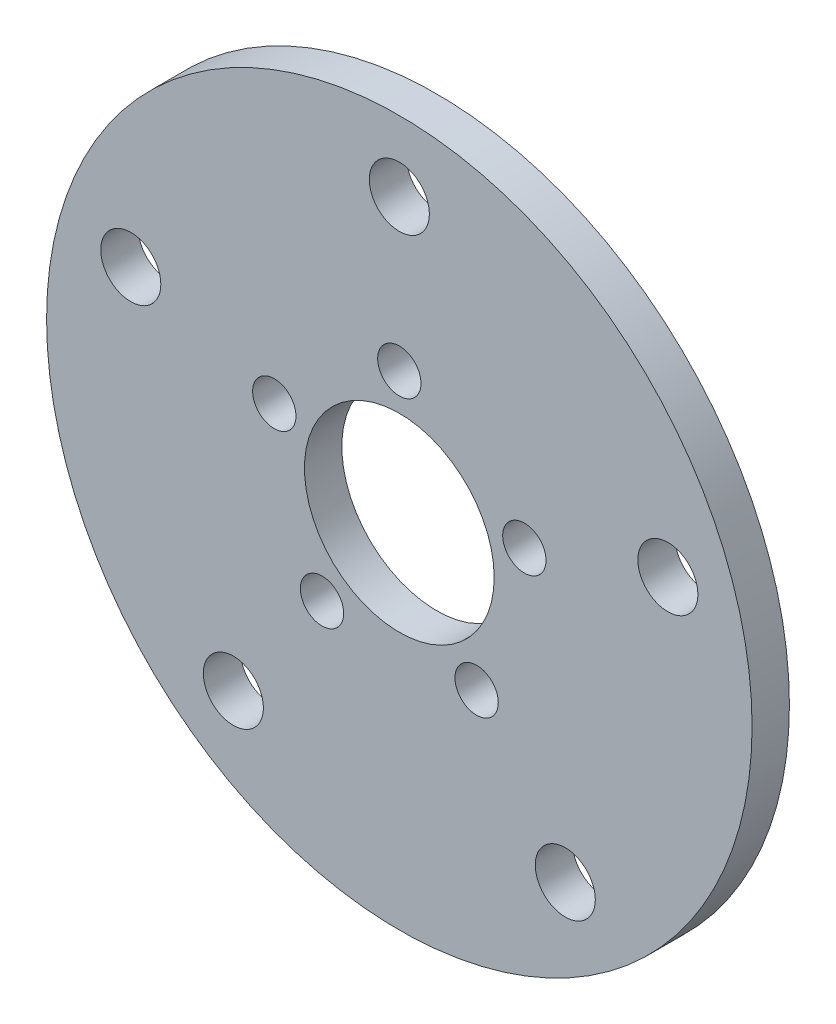
ISO-10303-21;
HEADER;
FILE_DESCRIPTION(('STEP AP214'),'2;1');
FILE_NAME('part.step','',(''),(''),'','','');
FILE_SCHEMA(('AUTOMOTIVE_DESIGN { 1 0 10303 214 1 1 1 1 }'));
ENDSEC;
DATA;
#1=APPLICATION_CONTEXT('core data for automotive mechanical design processes');
#2=APPLICATION_PROTOCOL_DEFINITION('international standard','automotive_design',2000,#1);
#3=PRODUCT_CONTEXT('',#1,'mechanical');
#4=PRODUCT('Part','Part','',(#3));
#5=PRODUCT_RELATED_PRODUCT_CATEGORY('part','',(#4));
#6=PRODUCT_DEFINITION_FORMATION('','',#4);
#7=PRODUCT_DEFINITION_CONTEXT('part definition',#1,'design');
#8=PRODUCT_DEFINITION('design','',#6,#7);
#9=PRODUCT_DEFINITION_SHAPE('','',#8);
#10=(LENGTH_UNIT() NAMED_UNIT(*) SI_UNIT(.MILLI.,.METRE.));
#11=(NAMED_UNIT(*) PLANE_ANGLE_UNIT() SI_UNIT($,.RADIAN.));
#12=(NAMED_UNIT(*) SI_UNIT($,.STERADIAN.) SOLID_ANGLE_UNIT());
#13=UNCERTAINTY_MEASURE_WITH_UNIT(LENGTH_MEASURE(1.E-05),#10,'distance_accuracy_value','');
#14=(GEOMETRIC_REPRESENTATION_CONTEXT(3) GLOBAL_UNCERTAINTY_ASSIGNED_CONTEXT((#13)) GLOBAL_UNIT_ASSIGNED_CONTEXT((#10,
#11,#12)) REPRESENTATION_CONTEXT('',''));
#15=CARTESIAN_POINT('',(0.,0.,0.));
#16=DIRECTION('',(0.,0.,1.));
#17=DIRECTION('',(1.,0.,0.));
#18=AXIS2_PLACEMENT_3D('',#15,#16,#17);
#19=CARTESIAN_POINT('',(0.,0.,3.175));
#20=DIRECTION('',(0.,0.,1.));
#21=DIRECTION('',(1.,0.,0.));
#22=AXIS2_PLACEMENT_3D('',#19,#20,#21);
#23=PLANE('',#22);
#24=CARTESIAN_POINT('',(-10.6290076261146,3.45357392913453,3.175));
#25=DIRECTION('',(0.,0.,1.));
#26=DIRECTION('',(1.,0.,0.));
#27=AXIS2_PLACEMENT_3D('',#24,#25,#26);
#28=CIRCLE('',#27,1.8415);
#29=CARTESIAN_POINT('',(-8.7875076261146,3.45357392913453,3.175));
#30=VERTEX_POINT('',#29);
#31=EDGE_CURVE('E101',#30,#30,#28,.T.);
#32=ORIENTED_EDGE('',*,*,#31,.F.);
#33=EDGE_LOOP('',(#32));
#34=FACE_BOUND('',#33,.T.);
#35=CARTESIAN_POINT('',(-6.56908797962076,-9.04157392913436,3.175));
#36=DIRECTION('',(0.,0.,1.));
#37=DIRECTION('',(1.,0.,0.));
#38=AXIS2_PLACEMENT_3D('',#35,#36,#37);
#39=CIRCLE('',#38,1.8415);
#40=CARTESIAN_POINT('',(-4.72758797962076,-9.04157392913436,3.175));
#41=VERTEX_POINT('',#40);
#42=EDGE_CURVE('E89',#41,#41,#39,.T.);
#43=ORIENTED_EDGE('',*,*,#42,.F.);
#44=EDGE_LOOP('',(#43));
#45=FACE_BOUND('',#44,.T.);
#46=CARTESIAN_POINT('',(6.56908797962063,-9.04157392913445,3.175));
#47=DIRECTION('',(0.,0.,1.));
#48=DIRECTION('',(1.,0.,0.));
#49=AXIS2_PLACEMENT_3D('',#46,#47,#48);
#50=CIRCLE('',#49,1.8415);
#51=CARTESIAN_POINT('',(8.41058797962063,-9.04157392913445,3.175));
#52=VERTEX_POINT('',#51);
#53=EDGE_CURVE('E77',#52,#52,#50,.T.);
#54=ORIENTED_EDGE('',*,*,#53,.F.);
#55=EDGE_LOOP('',(#54));
#56=FACE_BOUND('',#55,.T.);
#57=CARTESIAN_POINT('',(10.6290076261147,3.45357392913438,3.175));
#58=DIRECTION('',(0.,0.,1.));
#59=DIRECTION('',(1.,0.,0.));
#60=AXIS2_PLACEMENT_3D('',#57,#58,#59);
#61=CIRCLE('',#60,1.8415);
#62=CARTESIAN_POINT('',(12.4705076261146,3.45357392913438,3.175));
#63=VERTEX_POINT('',#62);
#64=EDGE_CURVE('E65',#63,#63,#61,.T.);
#65=ORIENTED_EDGE('',*,*,#64,.F.);
#66=EDGE_LOOP('',(#65));
#67=FACE_BOUND('',#66,.T.);
#68=CARTESIAN_POINT('',(0.,11.176,3.175));
#69=DIRECTION('',(0.,0.,1.));
#70=DIRECTION('',(1.,0.,0.));
#71=AXIS2_PLACEMENT_3D('',#68,#69,#70);
#72=CIRCLE('',#71,1.8415);
#73=CARTESIAN_POINT('',(1.8415,11.176,3.175));
#74=VERTEX_POINT('',#73);
#75=EDGE_CURVE('E53',#74,#74,#72,.T.);
#76=ORIENTED_EDGE('',*,*,#75,.F.);
#77=EDGE_LOOP('',(#76));
#78=FACE_BOUND('',#77,.T.);
#79=CARTESIAN_POINT('',(0.,0.,3.175));
#80=DIRECTION('',(0.,0.,1.));
#81=DIRECTION('',(1.,0.,0.));
#82=AXIS2_PLACEMENT_3D('',#79,#80,#81);
#83=CIRCLE('',#82,29.9846999999994);
#84=CARTESIAN_POINT('',(29.9846999999994,0.,3.175));
#85=VERTEX_POINT('',#84);
#86=EDGE_CURVE('E10',#85,#85,#83,.T.);
#87=ORIENTED_EDGE('',*,*,#86,.T.);
#88=EDGE_LOOP('',(#87));
#89=FACE_BOUND('',#88,.T.);
#90=CARTESIAN_POINT('',(0.,0.,3.175));
#91=DIRECTION('',(0.,0.,1.));
#92=DIRECTION('',(1.,0.,0.));
#93=AXIS2_PLACEMENT_3D('',#90,#91,#92);
#94=CIRCLE('',#93,8.0645);
#95=CARTESIAN_POINT('',(8.0645,0.,3.175));
#96=VERTEX_POINT('',#95);
#97=EDGE_CURVE('E48',#96,#96,#94,.T.);
#98=ORIENTED_EDGE('',*,*,#97,.F.);
#99=EDGE_LOOP('',(#98));
#100=FACE_BOUND('',#99,.T.);
#101=CARTESIAN_POINT('',(0.,24.000000006,3.175));
#102=DIRECTION('',(0.,0.,1.));
#103=DIRECTION('',(1.,0.,0.));
#104=AXIS2_PLACEMENT_3D('',#101,#102,#103);
#105=CIRCLE('',#104,2.55270000000001);
#106=CARTESIAN_POINT('',(2.55270000000008,24.000000006,3.175));
#107=VERTEX_POINT('',#106);
#108=EDGE_CURVE('E59',#107,#107,#105,.T.);
#109=ORIENTED_EDGE('',*,*,#108,.F.);
#110=EDGE_LOOP('',(#109));
#111=FACE_BOUND('',#110,.T.);
#112=CARTESIAN_POINT('',(22.8253563967901,7.41640786685277,3.175));
#113=DIRECTION('',(0.,0.,1.));
#114=DIRECTION('',(1.,0.,0.));
#115=AXIS2_PLACEMENT_3D('',#112,#113,#114);
#116=CIRCLE('',#115,2.55269999999992);
#117=CARTESIAN_POINT('',(25.37805639679,7.41640786685277,3.175));
#118=VERTEX_POINT('',#117);
#119=EDGE_CURVE('E71',#118,#118,#116,.T.);
#120=ORIENTED_EDGE('',*,*,#119,.F.);
#121=EDGE_LOOP('',(#120));
#122=FACE_BOUND('',#121,.T.);
#123=CARTESIAN_POINT('',(14.1068460585461,-19.4164078698529,3.175));
#124=DIRECTION('',(0.,0.,1.));
#125=DIRECTION('',(1.,0.,0.));
#126=AXIS2_PLACEMENT_3D('',#123,#124,#125);
#127=CIRCLE('',#126,2.55270000000003);
#128=CARTESIAN_POINT('',(16.6595460585461,-19.4164078698529,3.175));
#129=VERTEX_POINT('',#128);
#130=EDGE_CURVE('E83',#129,#129,#127,.T.);
#131=ORIENTED_EDGE('',*,*,#130,.F.);
#132=EDGE_LOOP('',(#131));
#133=FACE_BOUND('',#132,.T.);
#134=CARTESIAN_POINT('',(-14.1068460585461,-19.4164078698528,3.175));
#135=DIRECTION('',(0.,0.,1.));
#136=DIRECTION('',(1.,0.,0.));
#137=AXIS2_PLACEMENT_3D('',#134,#135,#136);
#138=CIRCLE('',#137,2.55270000000003);
#139=CARTESIAN_POINT('',(-11.5541460585461,-19.4164078698528,3.175));
#140=VERTEX_POINT('',#139);
#141=EDGE_CURVE('E95',#140,#140,#138,.T.);
#142=ORIENTED_EDGE('',*,*,#141,.F.);
#143=EDGE_LOOP('',(#142));
#144=FACE_BOUND('',#143,.T.);
#145=CARTESIAN_POINT('',(-22.82535639679,7.41640786685288,3.175));
#146=DIRECTION('',(0.,0.,1.));
#147=DIRECTION('',(1.,0.,0.));
#148=AXIS2_PLACEMENT_3D('',#145,#146,#147);
#149=CIRCLE('',#148,2.55269999999992);
#150=CARTESIAN_POINT('',(-20.27265639679,7.41640786685288,3.175));
#151=VERTEX_POINT('',#150);
#152=EDGE_CURVE('E107',#151,#151,#149,.T.);
#153=ORIENTED_EDGE('',*,*,#152,.F.);
#154=EDGE_LOOP('',(#153));
#155=FACE_BOUND('',#154,.T.);
#156=ADVANCED_FACE('F37',(#34,#45,#56,#67,#78,#89,#100,#111,#122,#133,#144,#155),#23,.T.);
#157=CARTESIAN_POINT('',(0.,0.,0.));
#158=DIRECTION('',(0.,0.,1.));
#159=DIRECTION('',(1.,0.,0.));
#160=AXIS2_PLACEMENT_3D('',#157,#158,#159);
#161=PLANE('',#160);
#162=CARTESIAN_POINT('',(0.,0.,0.));
#163=DIRECTION('',(0.,0.,1.));
#164=DIRECTION('',(1.,0.,0.));
#165=AXIS2_PLACEMENT_3D('',#162,#163,#164);
#166=CIRCLE('',#165,29.9846999999994);
#167=CARTESIAN_POINT('',(29.9846999999994,0.,0.));
#168=VERTEX_POINT('',#167);
#169=EDGE_CURVE('E41',#168,#168,#166,.T.);
#170=ORIENTED_EDGE('',*,*,#169,.F.);
#171=EDGE_LOOP('',(#170));
#172=FACE_BOUND('',#171,.T.);
#173=CARTESIAN_POINT('',(0.,0.,0.));
#174=DIRECTION('',(0.,0.,1.));
#175=DIRECTION('',(1.,0.,0.));
#176=AXIS2_PLACEMENT_3D('',#173,#174,#175);
#177=CIRCLE('',#176,8.0645);
#178=CARTESIAN_POINT('',(8.0645,0.,0.));
#179=VERTEX_POINT('',#178);
#180=EDGE_CURVE('E50',#179,#179,#177,.T.);
#181=ORIENTED_EDGE('',*,*,#180,.T.);
#182=EDGE_LOOP('',(#181));
#183=FACE_BOUND('',#182,.T.);
#184=CARTESIAN_POINT('',(0.,11.176,0.));
#185=DIRECTION('',(0.,0.,1.));
#186=DIRECTION('',(1.,0.,0.));
#187=AXIS2_PLACEMENT_3D('',#184,#185,#186);
#188=CIRCLE('',#187,1.8415);
#189=CARTESIAN_POINT('',(1.8415,11.176,0.));
#190=VERTEX_POINT('',#189);
#191=EDGE_CURVE('E56',#190,#190,#188,.T.);
#192=ORIENTED_EDGE('',*,*,#191,.T.);
#193=EDGE_LOOP('',(#192));
#194=FACE_BOUND('',#193,.T.);
#195=CARTESIAN_POINT('',(0.,24.000000006,0.));
#196=DIRECTION('',(0.,0.,1.));
#197=DIRECTION('',(1.,0.,0.));
#198=AXIS2_PLACEMENT_3D('',#195,#196,#197);
#199=CIRCLE('',#198,2.55270000000001);
#200=CARTESIAN_POINT('',(2.55270000000008,24.000000006,0.));
#201=VERTEX_POINT('',#200);
#202=EDGE_CURVE('E62',#201,#201,#199,.T.);
#203=ORIENTED_EDGE('',*,*,#202,.T.);
#204=EDGE_LOOP('',(#203));
#205=FACE_BOUND('',#204,.T.);
#206=CARTESIAN_POINT('',(10.6290076261147,3.45357392913438,0.));
#207=DIRECTION('',(0.,0.,1.));
#208=DIRECTION('',(1.,0.,0.));
#209=AXIS2_PLACEMENT_3D('',#206,#207,#208);
#210=CIRCLE('',#209,1.8415);
#211=CARTESIAN_POINT('',(12.4705076261146,3.45357392913438,0.));
#212=VERTEX_POINT('',#211);
#213=EDGE_CURVE('E68',#212,#212,#210,.T.);
#214=ORIENTED_EDGE('',*,*,#213,.T.);
#215=EDGE_LOOP('',(#214));
#216=FACE_BOUND('',#215,.T.);
#217=CARTESIAN_POINT('',(22.8253563967901,7.41640786685277,0.));
#218=DIRECTION('',(0.,0.,1.));
#219=DIRECTION('',(1.,0.,0.));
#220=AXIS2_PLACEMENT_3D('',#217,#218,#219);
#221=CIRCLE('',#220,2.55269999999992);
#222=CARTESIAN_POINT('',(25.37805639679,7.41640786685277,0.));
#223=VERTEX_POINT('',#222);
#224=EDGE_CURVE('E74',#223,#223,#221,.T.);
#225=ORIENTED_EDGE('',*,*,#224,.T.);
#226=EDGE_LOOP('',(#225));
#227=FACE_BOUND('',#226,.T.);
#228=CARTESIAN_POINT('',(6.56908797962063,-9.04157392913445,0.));
#229=DIRECTION('',(0.,0.,1.));
#230=DIRECTION('',(1.,0.,0.));
#231=AXIS2_PLACEMENT_3D('',#228,#229,#230);
#232=CIRCLE('',#231,1.8415);
#233=CARTESIAN_POINT('',(8.41058797962063,-9.04157392913445,0.));
#234=VERTEX_POINT('',#233);
#235=EDGE_CURVE('E80',#234,#234,#232,.T.);
#236=ORIENTED_EDGE('',*,*,#235,.T.);
#237=EDGE_LOOP('',(#236));
#238=FACE_BOUND('',#237,.T.);
#239=CARTESIAN_POINT('',(14.1068460585461,-19.4164078698529,0.));
#240=DIRECTION('',(0.,0.,1.));
#241=DIRECTION('',(1.,0.,0.));
#242=AXIS2_PLACEMENT_3D('',#239,#240,#241);
#243=CIRCLE('',#242,2.55270000000003);
#244=CARTESIAN_POINT('',(16.6595460585461,-19.4164078698529,0.));
#245=VERTEX_POINT('',#244);
#246=EDGE_CURVE('E86',#245,#245,#243,.T.);
#247=ORIENTED_EDGE('',*,*,#246,.T.);
#248=EDGE_LOOP('',(#247));
#249=FACE_BOUND('',#248,.T.);
#250=CARTESIAN_POINT('',(-6.56908797962076,-9.04157392913436,0.));
#251=DIRECTION('',(0.,0.,1.));
#252=DIRECTION('',(1.,0.,0.));
#253=AXIS2_PLACEMENT_3D('',#250,#251,#252);
#254=CIRCLE('',#253,1.8415);
#255=CARTESIAN_POINT('',(-4.72758797962076,-9.04157392913436,0.));
#256=VERTEX_POINT('',#255);
#257=EDGE_CURVE('E92',#256,#256,#254,.T.);
#258=ORIENTED_EDGE('',*,*,#257,.T.);
#259=EDGE_LOOP('',(#258));
#260=FACE_BOUND('',#259,.T.);
#261=CARTESIAN_POINT('',(-14.1068460585461,-19.4164078698528,0.));
#262=DIRECTION('',(0.,0.,1.));
#263=DIRECTION('',(1.,0.,0.));
#264=AXIS2_PLACEMENT_3D('',#261,#262,#263);
#265=CIRCLE('',#264,2.55270000000003);
#266=CARTESIAN_POINT('',(-11.5541460585461,-19.4164078698528,0.));
#267=VERTEX_POINT('',#266);
#268=EDGE_CURVE('E98',#267,#267,#265,.T.);
#269=ORIENTED_EDGE('',*,*,#268,.T.);
#270=EDGE_LOOP('',(#269));
#271=FACE_BOUND('',#270,.T.);
#272=CARTESIAN_POINT('',(-10.6290076261146,3.45357392913453,0.));
#273=DIRECTION('',(0.,0.,1.));
#274=DIRECTION('',(1.,0.,0.));
#275=AXIS2_PLACEMENT_3D('',#272,#273,#274);
#276=CIRCLE('',#275,1.8415);
#277=CARTESIAN_POINT('',(-8.7875076261146,3.45357392913453,0.));
#278=VERTEX_POINT('',#277);
#279=EDGE_CURVE('E104',#278,#278,#276,.T.);
#280=ORIENTED_EDGE('',*,*,#279,.T.);
#281=EDGE_LOOP('',(#280));
#282=FACE_BOUND('',#281,.T.);
#283=CARTESIAN_POINT('',(-22.82535639679,7.41640786685288,0.));
#284=DIRECTION('',(0.,0.,1.));
#285=DIRECTION('',(1.,0.,0.));
#286=AXIS2_PLACEMENT_3D('',#283,#284,#285);
#287=CIRCLE('',#286,2.55269999999992);
#288=CARTESIAN_POINT('',(-20.27265639679,7.41640786685288,0.));
#289=VERTEX_POINT('',#288);
#290=EDGE_CURVE('E110',#289,#289,#287,.T.);
#291=ORIENTED_EDGE('',*,*,#290,.T.);
#292=EDGE_LOOP('',(#291));
#293=FACE_BOUND('',#292,.T.);
#294=ADVANCED_FACE('F120',(#172,#183,#194,#205,#216,#227,#238,#249,#260,#271,#282,#293),#161,.F.);
#295=CARTESIAN_POINT('',(0.,0.,3.175));
#296=DIRECTION('',(0.,0.,-1.));
#297=DIRECTION('',(-1.,0.,0.));
#298=AXIS2_PLACEMENT_3D('',#295,#296,#297);
#299=CYLINDRICAL_SURFACE('',#298,29.9846999999994);
#300=ORIENTED_EDGE('',*,*,#86,.F.);
#301=EDGE_LOOP('',(#300));
#302=FACE_BOUND('',#301,.T.);
#303=ORIENTED_EDGE('',*,*,#169,.T.);
#304=EDGE_LOOP('',(#303));
#305=FACE_BOUND('',#304,.T.);
#306=ADVANCED_FACE('F39',(#302,#305),#299,.T.);
#307=CARTESIAN_POINT('',(0.,0.,3.175));
#308=DIRECTION('',(0.,0.,-1.));
#309=DIRECTION('',(-1.,0.,0.));
#310=AXIS2_PLACEMENT_3D('',#307,#308,#309);
#311=CYLINDRICAL_SURFACE('',#310,8.0645);
#312=ORIENTED_EDGE('',*,*,#97,.T.);
#313=EDGE_LOOP('',(#312));
#314=FACE_BOUND('',#313,.T.);
#315=ORIENTED_EDGE('',*,*,#180,.F.);
#316=EDGE_LOOP('',(#315));
#317=FACE_BOUND('',#316,.T.);
#318=ADVANCED_FACE('F130',(#314,#317),#311,.F.);
#319=CARTESIAN_POINT('',(0.,11.176,3.175));
#320=DIRECTION('',(0.,0.,-1.));
#321=DIRECTION('',(-1.,0.,0.));
#322=AXIS2_PLACEMENT_3D('',#319,#320,#321);
#323=CYLINDRICAL_SURFACE('',#322,1.8415);
#324=ORIENTED_EDGE('',*,*,#75,.T.);
#325=EDGE_LOOP('',(#324));
#326=FACE_BOUND('',#325,.T.);
#327=ORIENTED_EDGE('',*,*,#191,.F.);
#328=EDGE_LOOP('',(#327));
#329=FACE_BOUND('',#328,.T.);
#330=ADVANCED_FACE('F133',(#326,#329),#323,.F.);
#331=CARTESIAN_POINT('',(0.,24.000000006,3.175));
#332=DIRECTION('',(0.,0.,-1.));
#333=DIRECTION('',(-1.,0.,0.));
#334=AXIS2_PLACEMENT_3D('',#331,#332,#333);
#335=CYLINDRICAL_SURFACE('',#334,2.55270000000001);
#336=ORIENTED_EDGE('',*,*,#108,.T.);
#337=EDGE_LOOP('',(#336));
#338=FACE_BOUND('',#337,.T.);
#339=ORIENTED_EDGE('',*,*,#202,.F.);
#340=EDGE_LOOP('',(#339));
#341=FACE_BOUND('',#340,.T.);
#342=ADVANCED_FACE('F137',(#338,#341),#335,.F.);
#343=CARTESIAN_POINT('',(10.6290076261147,3.45357392913438,3.175));
#344=DIRECTION('',(0.,0.,-1.));
#345=DIRECTION('',(-1.,0.,0.));
#346=AXIS2_PLACEMENT_3D('',#343,#344,#345);
#347=CYLINDRICAL_SURFACE('',#346,1.8415);
#348=ORIENTED_EDGE('',*,*,#64,.T.);
#349=EDGE_LOOP('',(#348));
#350=FACE_BOUND('',#349,.T.);
#351=ORIENTED_EDGE('',*,*,#213,.F.);
#352=EDGE_LOOP('',(#351));
#353=FACE_BOUND('',#352,.T.);
#354=ADVANCED_FACE('F141',(#350,#353),#347,.F.);
#355=CARTESIAN_POINT('',(22.8253563967901,7.41640786685277,3.175));
#356=DIRECTION('',(0.,0.,-1.));
#357=DIRECTION('',(-1.,0.,0.));
#358=AXIS2_PLACEMENT_3D('',#355,#356,#357);
#359=CYLINDRICAL_SURFACE('',#358,2.55269999999992);
#360=ORIENTED_EDGE('',*,*,#119,.T.);
#361=EDGE_LOOP('',(#360));
#362=FACE_BOUND('',#361,.T.);
#363=ORIENTED_EDGE('',*,*,#224,.F.);
#364=EDGE_LOOP('',(#363));
#365=FACE_BOUND('',#364,.T.);
#366=ADVANCED_FACE('F145',(#362,#365),#359,.F.);
#367=CARTESIAN_POINT('',(6.56908797962063,-9.04157392913445,3.175));
#368=DIRECTION('',(0.,0.,-1.));
#369=DIRECTION('',(-1.,0.,0.));
#370=AXIS2_PLACEMENT_3D('',#367,#368,#369);
#371=CYLINDRICAL_SURFACE('',#370,1.8415);
#372=ORIENTED_EDGE('',*,*,#53,.T.);
#373=EDGE_LOOP('',(#372));
#374=FACE_BOUND('',#373,.T.);
#375=ORIENTED_EDGE('',*,*,#235,.F.);
#376=EDGE_LOOP('',(#375));
#377=FACE_BOUND('',#376,.T.);
#378=ADVANCED_FACE('F149',(#374,#377),#371,.F.);
#379=CARTESIAN_POINT('',(14.1068460585461,-19.4164078698529,3.175));
#380=DIRECTION('',(0.,0.,-1.));
#381=DIRECTION('',(-1.,0.,0.));
#382=AXIS2_PLACEMENT_3D('',#379,#380,#381);
#383=CYLINDRICAL_SURFACE('',#382,2.55270000000003);
#384=ORIENTED_EDGE('',*,*,#130,.T.);
#385=EDGE_LOOP('',(#384));
#386=FACE_BOUND('',#385,.T.);
#387=ORIENTED_EDGE('',*,*,#246,.F.);
#388=EDGE_LOOP('',(#387));
#389=FACE_BOUND('',#388,.T.);
#390=ADVANCED_FACE('F153',(#386,#389),#383,.F.);
#391=CARTESIAN_POINT('',(-6.56908797962076,-9.04157392913436,3.175));
#392=DIRECTION('',(0.,0.,-1.));
#393=DIRECTION('',(-1.,0.,0.));
#394=AXIS2_PLACEMENT_3D('',#391,#392,#393);
#395=CYLINDRICAL_SURFACE('',#394,1.8415);
#396=ORIENTED_EDGE('',*,*,#42,.T.);
#397=EDGE_LOOP('',(#396));
#398=FACE_BOUND('',#397,.T.);
#399=ORIENTED_EDGE('',*,*,#257,.F.);
#400=EDGE_LOOP('',(#399));
#401=FACE_BOUND('',#400,.T.);
#402=ADVANCED_FACE('F157',(#398,#401),#395,.F.);
#403=CARTESIAN_POINT('',(-14.1068460585461,-19.4164078698528,3.175));
#404=DIRECTION('',(0.,0.,-1.));
#405=DIRECTION('',(-1.,0.,0.));
#406=AXIS2_PLACEMENT_3D('',#403,#404,#405);
#407=CYLINDRICAL_SURFACE('',#406,2.55270000000003);
#408=ORIENTED_EDGE('',*,*,#141,.T.);
#409=EDGE_LOOP('',(#408));
#410=FACE_BOUND('',#409,.T.);
#411=ORIENTED_EDGE('',*,*,#268,.F.);
#412=EDGE_LOOP('',(#411));
#413=FACE_BOUND('',#412,.T.);
#414=ADVANCED_FACE('F161',(#410,#413),#407,.F.);
#415=CARTESIAN_POINT('',(-10.6290076261146,3.45357392913453,3.175));
#416=DIRECTION('',(0.,0.,-1.));
#417=DIRECTION('',(-1.,0.,0.));
#418=AXIS2_PLACEMENT_3D('',#415,#416,#417);
#419=CYLINDRICAL_SURFACE('',#418,1.8415);
#420=ORIENTED_EDGE('',*,*,#31,.T.);
#421=EDGE_LOOP('',(#420));
#422=FACE_BOUND('',#421,.T.);
#423=ORIENTED_EDGE('',*,*,#279,.F.);
#424=EDGE_LOOP('',(#423));
#425=FACE_BOUND('',#424,.T.);
#426=ADVANCED_FACE('F165',(#422,#425),#419,.F.);
#427=CARTESIAN_POINT('',(-22.82535639679,7.41640786685288,3.175));
#428=DIRECTION('',(0.,0.,-1.));
#429=DIRECTION('',(-1.,0.,0.));
#430=AXIS2_PLACEMENT_3D('',#427,#428,#429);
#431=CYLINDRICAL_SURFACE('',#430,2.55269999999992);
#432=ORIENTED_EDGE('',*,*,#152,.T.);
#433=EDGE_LOOP('',(#432));
#434=FACE_BOUND('',#433,.T.);
#435=ORIENTED_EDGE('',*,*,#290,.F.);
#436=EDGE_LOOP('',(#435));
#437=FACE_BOUND('',#436,.T.);
#438=ADVANCED_FACE('F116',(#434,#437),#431,.F.);
#439=CLOSED_SHELL('',(#156,#294,#306,#318,#330,#342,#354,#366,#378,#390,#402,#414,#426,#438));
#440=MANIFOLD_SOLID_BREP('B2',#439);
#441=ADVANCED_BREP_SHAPE_REPRESENTATION('',(#18,#440),#14);
#442=SHAPE_DEFINITION_REPRESENTATION(#9,#441);
ENDSEC;
END-ISO-10303-21;
